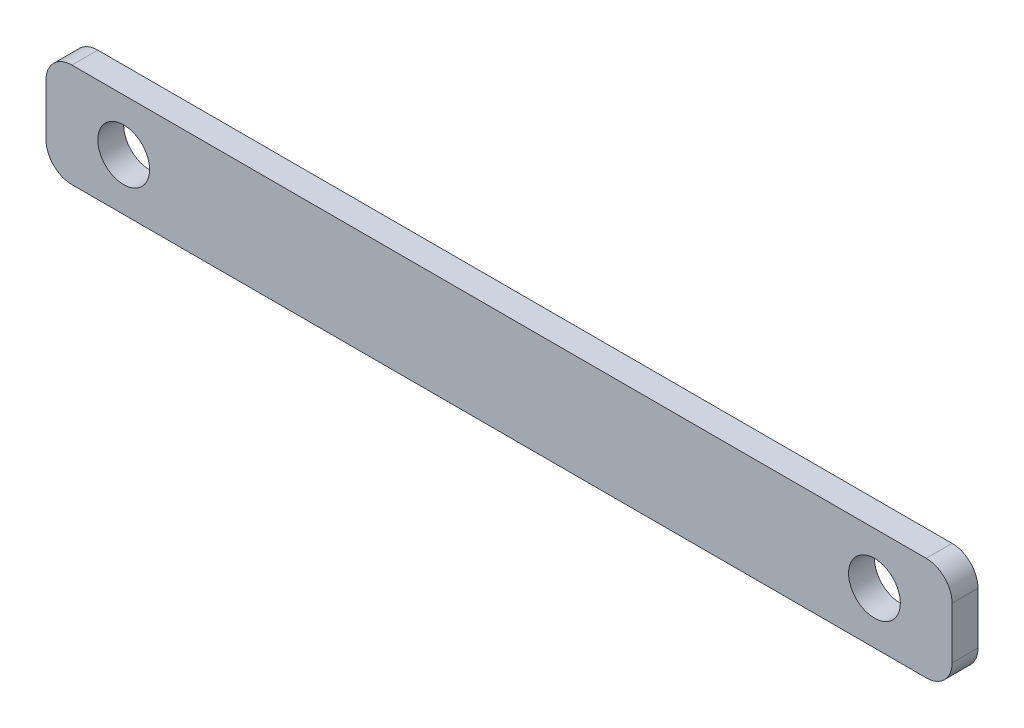
ISO-10303-21;
HEADER;
FILE_DESCRIPTION(('STEP AP214'),'2;1');
FILE_NAME('part.step','',(''),(''),'','','');
FILE_SCHEMA(('AUTOMOTIVE_DESIGN { 1 0 10303 214 1 1 1 1 }'));
ENDSEC;
DATA;
#1=APPLICATION_CONTEXT('core data for automotive mechanical design processes');
#2=APPLICATION_PROTOCOL_DEFINITION('international standard','automotive_design',2000,#1);
#3=PRODUCT_CONTEXT('',#1,'mechanical');
#4=PRODUCT('Part','Part','',(#3));
#5=PRODUCT_RELATED_PRODUCT_CATEGORY('part','',(#4));
#6=PRODUCT_DEFINITION_FORMATION('','',#4);
#7=PRODUCT_DEFINITION_CONTEXT('part definition',#1,'design');
#8=PRODUCT_DEFINITION('design','',#6,#7);
#9=PRODUCT_DEFINITION_SHAPE('','',#8);
#10=(LENGTH_UNIT() NAMED_UNIT(*) SI_UNIT(.MILLI.,.METRE.));
#11=(NAMED_UNIT(*) PLANE_ANGLE_UNIT() SI_UNIT($,.RADIAN.));
#12=(NAMED_UNIT(*) SI_UNIT($,.STERADIAN.) SOLID_ANGLE_UNIT());
#13=UNCERTAINTY_MEASURE_WITH_UNIT(LENGTH_MEASURE(1.E-05),#10,'distance_accuracy_value','');
#14=(GEOMETRIC_REPRESENTATION_CONTEXT(3) GLOBAL_UNCERTAINTY_ASSIGNED_CONTEXT((#13)) GLOBAL_UNIT_ASSIGNED_CONTEXT((#10,
#11,#12)) REPRESENTATION_CONTEXT('',''));
#15=CARTESIAN_POINT('',(0.,0.,0.));
#16=DIRECTION('',(0.,0.,1.));
#17=DIRECTION('',(1.,0.,0.));
#18=AXIS2_PLACEMENT_3D('',#15,#16,#17);
#19=CARTESIAN_POINT('',(140.,121.994660309072,5.));
#20=DIRECTION('',(0.,0.,1.));
#21=DIRECTION('',(1.,0.,0.));
#22=AXIS2_PLACEMENT_3D('',#19,#20,#21);
#23=PLANE('',#22);
#24=CARTESIAN_POINT('',(-170.,131.994660309072,5.));
#25=DIRECTION('',(0.,0.,1.));
#26=DIRECTION('',(1.,0.,0.));
#27=AXIS2_PLACEMENT_3D('',#24,#25,#26);
#28=CIRCLE('',#27,10.);
#29=CARTESIAN_POINT('',(-160.,131.994660309072,5.));
#30=VERTEX_POINT('',#29);
#31=EDGE_CURVE('E135',#30,#30,#28,.T.);
#32=ORIENTED_EDGE('',*,*,#31,.F.);
#33=EDGE_LOOP('',(#32));
#34=FACE_BOUND('',#33,.T.);
#35=CARTESIAN_POINT('',(140.,121.994660309072,5.));
#36=DIRECTION('',(0.,0.,1.));
#37=DIRECTION('',(1.,0.,0.));
#38=AXIS2_PLACEMENT_3D('',#35,#36,#37);
#39=CIRCLE('',#38,9.99999999999999);
#40=CARTESIAN_POINT('',(140.,111.994660309072,5.));
#41=VERTEX_POINT('',#40);
#42=CARTESIAN_POINT('',(150.,121.994660309072,5.));
#43=VERTEX_POINT('',#42);
#44=EDGE_CURVE('E146',#41,#43,#39,.T.);
#45=ORIENTED_EDGE('',*,*,#44,.T.);
#46=DIRECTION('',(0.,1.,0.));
#47=VECTOR('',#46,1.);
#48=CARTESIAN_POINT('',(150.,141.994660309072,5.));
#49=LINE('',#48,#47);
#50=CARTESIAN_POINT('',(150.,141.994660309072,5.));
#51=VERTEX_POINT('',#50);
#52=EDGE_CURVE('E94',#43,#51,#49,.T.);
#53=ORIENTED_EDGE('',*,*,#52,.T.);
#54=CARTESIAN_POINT('',(140.,141.994660309072,5.));
#55=DIRECTION('',(0.,0.,1.));
#56=DIRECTION('',(-1.,0.,0.));
#57=AXIS2_PLACEMENT_3D('',#54,#55,#56);
#58=CIRCLE('',#57,10.);
#59=CARTESIAN_POINT('',(140.,151.994660309072,5.));
#60=VERTEX_POINT('',#59);
#61=EDGE_CURVE('E161',#51,#60,#58,.T.);
#62=ORIENTED_EDGE('',*,*,#61,.T.);
#63=DIRECTION('',(-1.,0.,0.));
#64=VECTOR('',#63,1.);
#65=CARTESIAN_POINT('',(-190.,151.994660309072,5.));
#66=LINE('',#65,#64);
#67=CARTESIAN_POINT('',(-190.,151.994660309072,5.));
#68=VERTEX_POINT('',#67);
#69=EDGE_CURVE('E174',#60,#68,#66,.T.);
#70=ORIENTED_EDGE('',*,*,#69,.T.);
#71=CARTESIAN_POINT('',(-190.,141.994660309072,5.));
#72=DIRECTION('',(0.,0.,1.));
#73=DIRECTION('',(1.,0.,0.));
#74=AXIS2_PLACEMENT_3D('',#71,#72,#73);
#75=CIRCLE('',#74,9.99999999999999);
#76=CARTESIAN_POINT('',(-200.,141.994660309072,5.));
#77=VERTEX_POINT('',#76);
#78=EDGE_CURVE('E113',#68,#77,#75,.T.);
#79=ORIENTED_EDGE('',*,*,#78,.T.);
#80=DIRECTION('',(0.,-1.,0.));
#81=VECTOR('',#80,1.);
#82=CARTESIAN_POINT('',(-200.,141.994660309072,5.));
#83=LINE('',#82,#81);
#84=CARTESIAN_POINT('',(-200.,121.994660309072,5.));
#85=VERTEX_POINT('',#84);
#86=EDGE_CURVE('E107',#77,#85,#83,.T.);
#87=ORIENTED_EDGE('',*,*,#86,.T.);
#88=CARTESIAN_POINT('',(-190.,121.994660309072,5.));
#89=DIRECTION('',(0.,0.,1.));
#90=DIRECTION('',(1.,0.,0.));
#91=AXIS2_PLACEMENT_3D('',#88,#89,#90);
#92=CIRCLE('',#91,10.);
#93=CARTESIAN_POINT('',(-190.,111.994660309072,5.));
#94=VERTEX_POINT('',#93);
#95=EDGE_CURVE('E111',#85,#94,#92,.T.);
#96=ORIENTED_EDGE('',*,*,#95,.T.);
#97=DIRECTION('',(1.,0.,0.));
#98=VECTOR('',#97,1.);
#99=CARTESIAN_POINT('',(-190.,111.994660309072,5.));
#100=LINE('',#99,#98);
#101=EDGE_CURVE('E51',#94,#41,#100,.T.);
#102=ORIENTED_EDGE('',*,*,#101,.T.);
#103=EDGE_LOOP('',(#45,#53,#62,#70,#79,#87,#96,#102));
#104=FACE_BOUND('',#103,.T.);
#105=CARTESIAN_POINT('',(120.,131.994660309072,5.));
#106=DIRECTION('',(0.,0.,1.));
#107=DIRECTION('',(1.,0.,0.));
#108=AXIS2_PLACEMENT_3D('',#105,#106,#107);
#109=CIRCLE('',#108,10.);
#110=CARTESIAN_POINT('',(130.,131.994660309072,5.));
#111=VERTEX_POINT('',#110);
#112=EDGE_CURVE('E183',#111,#111,#109,.T.);
#113=ORIENTED_EDGE('',*,*,#112,.F.);
#114=EDGE_LOOP('',(#113));
#115=FACE_BOUND('',#114,.T.);
#116=ADVANCED_FACE('F34',(#34,#104,#115),#23,.T.);
#117=CARTESIAN_POINT('',(140.,121.994660309072,-5.));
#118=DIRECTION('',(0.,0.,1.));
#119=DIRECTION('',(1.,0.,0.));
#120=AXIS2_PLACEMENT_3D('',#117,#118,#119);
#121=PLANE('',#120);
#122=CARTESIAN_POINT('',(140.,121.994660309072,-5.));
#123=DIRECTION('',(0.,0.,1.));
#124=DIRECTION('',(1.,0.,0.));
#125=AXIS2_PLACEMENT_3D('',#122,#123,#124);
#126=CIRCLE('',#125,9.99999999999999);
#127=CARTESIAN_POINT('',(140.,111.994660309072,-5.));
#128=VERTEX_POINT('',#127);
#129=CARTESIAN_POINT('',(150.,121.994660309072,-5.));
#130=VERTEX_POINT('',#129);
#131=EDGE_CURVE('E131',#128,#130,#126,.T.);
#132=ORIENTED_EDGE('',*,*,#131,.F.);
#133=DIRECTION('',(1.,0.,0.));
#134=VECTOR('',#133,1.);
#135=CARTESIAN_POINT('',(-190.,111.994660309072,-5.));
#136=LINE('',#135,#134);
#137=CARTESIAN_POINT('',(-190.,111.994660309072,-5.));
#138=VERTEX_POINT('',#137);
#139=EDGE_CURVE('E86',#138,#128,#136,.T.);
#140=ORIENTED_EDGE('',*,*,#139,.F.);
#141=CARTESIAN_POINT('',(-190.,121.994660309072,-5.));
#142=DIRECTION('',(0.,0.,1.));
#143=DIRECTION('',(1.,0.,0.));
#144=AXIS2_PLACEMENT_3D('',#141,#142,#143);
#145=CIRCLE('',#144,10.);
#146=CARTESIAN_POINT('',(-200.,121.994660309072,-5.));
#147=VERTEX_POINT('',#146);
#148=EDGE_CURVE('E80',#147,#138,#145,.T.);
#149=ORIENTED_EDGE('',*,*,#148,.F.);
#150=DIRECTION('',(0.,-1.,0.));
#151=VECTOR('',#150,1.);
#152=CARTESIAN_POINT('',(-200.,141.994660309072,-5.));
#153=LINE('',#152,#151);
#154=CARTESIAN_POINT('',(-200.,141.994660309072,-5.));
#155=VERTEX_POINT('',#154);
#156=EDGE_CURVE('E121',#155,#147,#153,.T.);
#157=ORIENTED_EDGE('',*,*,#156,.F.);
#158=CARTESIAN_POINT('',(-190.,141.994660309072,-5.));
#159=DIRECTION('',(0.,0.,1.));
#160=DIRECTION('',(1.,0.,0.));
#161=AXIS2_PLACEMENT_3D('',#158,#159,#160);
#162=CIRCLE('',#161,9.99999999999999);
#163=CARTESIAN_POINT('',(-190.,151.994660309072,-5.));
#164=VERTEX_POINT('',#163);
#165=EDGE_CURVE('E141',#164,#155,#162,.T.);
#166=ORIENTED_EDGE('',*,*,#165,.F.);
#167=DIRECTION('',(-1.,0.,0.));
#168=VECTOR('',#167,1.);
#169=CARTESIAN_POINT('',(-190.,151.994660309072,-5.));
#170=LINE('',#169,#168);
#171=CARTESIAN_POINT('',(140.,151.994660309072,-5.));
#172=VERTEX_POINT('',#171);
#173=EDGE_CURVE('E139',#172,#164,#170,.T.);
#174=ORIENTED_EDGE('',*,*,#173,.F.);
#175=CARTESIAN_POINT('',(140.,141.994660309072,-5.));
#176=DIRECTION('',(0.,0.,1.));
#177=DIRECTION('',(-1.,0.,0.));
#178=AXIS2_PLACEMENT_3D('',#175,#176,#177);
#179=CIRCLE('',#178,10.);
#180=CARTESIAN_POINT('',(150.,141.994660309072,-5.));
#181=VERTEX_POINT('',#180);
#182=EDGE_CURVE('E137',#181,#172,#179,.T.);
#183=ORIENTED_EDGE('',*,*,#182,.F.);
#184=DIRECTION('',(0.,1.,0.));
#185=VECTOR('',#184,1.);
#186=CARTESIAN_POINT('',(150.,141.994660309072,-5.));
#187=LINE('',#186,#185);
#188=EDGE_CURVE('E134',#130,#181,#187,.T.);
#189=ORIENTED_EDGE('',*,*,#188,.F.);
#190=EDGE_LOOP('',(#132,#140,#149,#157,#166,#174,#183,#189));
#191=FACE_BOUND('',#190,.T.);
#192=CARTESIAN_POINT('',(-170.,131.994660309072,-5.));
#193=DIRECTION('',(0.,0.,1.));
#194=DIRECTION('',(1.,0.,0.));
#195=AXIS2_PLACEMENT_3D('',#192,#193,#194);
#196=CIRCLE('',#195,10.);
#197=CARTESIAN_POINT('',(-160.,131.994660309072,-5.));
#198=VERTEX_POINT('',#197);
#199=EDGE_CURVE('E180',#198,#198,#196,.T.);
#200=ORIENTED_EDGE('',*,*,#199,.T.);
#201=EDGE_LOOP('',(#200));
#202=FACE_BOUND('',#201,.T.);
#203=CARTESIAN_POINT('',(120.,131.994660309072,-5.));
#204=DIRECTION('',(0.,0.,1.));
#205=DIRECTION('',(1.,0.,0.));
#206=AXIS2_PLACEMENT_3D('',#203,#204,#205);
#207=CIRCLE('',#206,10.);
#208=CARTESIAN_POINT('',(130.,131.994660309072,-5.));
#209=VERTEX_POINT('',#208);
#210=EDGE_CURVE('E186',#209,#209,#207,.T.);
#211=ORIENTED_EDGE('',*,*,#210,.T.);
#212=EDGE_LOOP('',(#211));
#213=FACE_BOUND('',#212,.T.);
#214=ADVANCED_FACE('F165',(#191,#202,#213),#121,.F.);
#215=CARTESIAN_POINT('',(140.,121.994660309072,5.));
#216=DIRECTION('',(0.,0.,-1.));
#217=DIRECTION('',(-1.,0.,0.));
#218=AXIS2_PLACEMENT_3D('',#215,#216,#217);
#219=CYLINDRICAL_SURFACE('',#218,9.99999999999999);
#220=ORIENTED_EDGE('',*,*,#131,.T.);
#221=DIRECTION('',(0.,0.,-1.));
#222=VECTOR('',#221,1.);
#223=CARTESIAN_POINT('',(150.,121.994660309072,5.));
#224=LINE('',#223,#222);
#225=EDGE_CURVE('E11',#43,#130,#224,.T.);
#226=ORIENTED_EDGE('',*,*,#225,.F.);
#227=ORIENTED_EDGE('',*,*,#44,.F.);
#228=DIRECTION('',(0.,0.,-1.));
#229=VECTOR('',#228,1.);
#230=CARTESIAN_POINT('',(140.,111.994660309072,5.));
#231=LINE('',#230,#229);
#232=EDGE_CURVE('E127',#41,#128,#231,.T.);
#233=ORIENTED_EDGE('',*,*,#232,.T.);
#234=EDGE_LOOP('',(#220,#226,#227,#233));
#235=FACE_BOUND('',#234,.T.);
#236=ADVANCED_FACE('F36',(#235),#219,.T.);
#237=CARTESIAN_POINT('',(150.,141.994660309072,5.));
#238=DIRECTION('',(-1.,0.,0.));
#239=DIRECTION('',(0.,0.,1.));
#240=AXIS2_PLACEMENT_3D('',#237,#238,#239);
#241=PLANE('',#240);
#242=ORIENTED_EDGE('',*,*,#188,.T.);
#243=DIRECTION('',(0.,0.,-1.));
#244=VECTOR('',#243,1.);
#245=CARTESIAN_POINT('',(150.,141.994660309072,5.));
#246=LINE('',#245,#244);
#247=EDGE_CURVE('E43',#51,#181,#246,.T.);
#248=ORIENTED_EDGE('',*,*,#247,.F.);
#249=ORIENTED_EDGE('',*,*,#52,.F.);
#250=ORIENTED_EDGE('',*,*,#225,.T.);
#251=EDGE_LOOP('',(#242,#248,#249,#250));
#252=FACE_BOUND('',#251,.T.);
#253=ADVANCED_FACE('F218',(#252),#241,.F.);
#254=CARTESIAN_POINT('',(140.,141.994660309072,5.));
#255=DIRECTION('',(0.,0.,-1.));
#256=DIRECTION('',(-1.,0.,0.));
#257=AXIS2_PLACEMENT_3D('',#254,#255,#256);
#258=CYLINDRICAL_SURFACE('',#257,10.);
#259=ORIENTED_EDGE('',*,*,#182,.T.);
#260=DIRECTION('',(0.,0.,-1.));
#261=VECTOR('',#260,1.);
#262=CARTESIAN_POINT('',(140.,151.994660309072,5.));
#263=LINE('',#262,#261);
#264=EDGE_CURVE('E153',#60,#172,#263,.T.);
#265=ORIENTED_EDGE('',*,*,#264,.F.);
#266=ORIENTED_EDGE('',*,*,#61,.F.);
#267=ORIENTED_EDGE('',*,*,#247,.T.);
#268=EDGE_LOOP('',(#259,#265,#266,#267));
#269=FACE_BOUND('',#268,.T.);
#270=ADVANCED_FACE('F159',(#269),#258,.T.);
#271=CARTESIAN_POINT('',(-190.,151.994660309072,5.));
#272=DIRECTION('',(0.,-1.,0.));
#273=DIRECTION('',(1.,0.,0.));
#274=AXIS2_PLACEMENT_3D('',#271,#272,#273);
#275=PLANE('',#274);
#276=ORIENTED_EDGE('',*,*,#173,.T.);
#277=DIRECTION('',(0.,0.,-1.));
#278=VECTOR('',#277,1.);
#279=CARTESIAN_POINT('',(-190.,151.994660309072,5.));
#280=LINE('',#279,#278);
#281=EDGE_CURVE('E150',#68,#164,#280,.T.);
#282=ORIENTED_EDGE('',*,*,#281,.F.);
#283=ORIENTED_EDGE('',*,*,#69,.F.);
#284=ORIENTED_EDGE('',*,*,#264,.T.);
#285=EDGE_LOOP('',(#276,#282,#283,#284));
#286=FACE_BOUND('',#285,.T.);
#287=ADVANCED_FACE('F170',(#286),#275,.F.);
#288=CARTESIAN_POINT('',(-190.,141.994660309072,5.));
#289=DIRECTION('',(0.,0.,-1.));
#290=DIRECTION('',(-1.,0.,0.));
#291=AXIS2_PLACEMENT_3D('',#288,#289,#290);
#292=CYLINDRICAL_SURFACE('',#291,9.99999999999999);
#293=ORIENTED_EDGE('',*,*,#165,.T.);
#294=DIRECTION('',(0.,0.,-1.));
#295=VECTOR('',#294,1.);
#296=CARTESIAN_POINT('',(-200.,141.994660309072,5.));
#297=LINE('',#296,#295);
#298=EDGE_CURVE('E122',#77,#155,#297,.T.);
#299=ORIENTED_EDGE('',*,*,#298,.F.);
#300=ORIENTED_EDGE('',*,*,#78,.F.);
#301=ORIENTED_EDGE('',*,*,#281,.T.);
#302=EDGE_LOOP('',(#293,#299,#300,#301));
#303=FACE_BOUND('',#302,.T.);
#304=ADVANCED_FACE('F173',(#303),#292,.T.);
#305=CARTESIAN_POINT('',(-200.,141.994660309072,5.));
#306=DIRECTION('',(1.,0.,0.));
#307=DIRECTION('',(0.,0.,-1.));
#308=AXIS2_PLACEMENT_3D('',#305,#306,#307);
#309=PLANE('',#308);
#310=ORIENTED_EDGE('',*,*,#156,.T.);
#311=DIRECTION('',(0.,0.,-1.));
#312=VECTOR('',#311,1.);
#313=CARTESIAN_POINT('',(-200.,121.994660309072,5.));
#314=LINE('',#313,#312);
#315=EDGE_CURVE('E118',#85,#147,#314,.T.);
#316=ORIENTED_EDGE('',*,*,#315,.F.);
#317=ORIENTED_EDGE('',*,*,#86,.F.);
#318=ORIENTED_EDGE('',*,*,#298,.T.);
#319=EDGE_LOOP('',(#310,#316,#317,#318));
#320=FACE_BOUND('',#319,.T.);
#321=ADVANCED_FACE('F119',(#320),#309,.F.);
#322=CARTESIAN_POINT('',(-190.,121.994660309072,5.));
#323=DIRECTION('',(0.,0.,-1.));
#324=DIRECTION('',(-1.,0.,0.));
#325=AXIS2_PLACEMENT_3D('',#322,#323,#324);
#326=CYLINDRICAL_SURFACE('',#325,10.);
#327=ORIENTED_EDGE('',*,*,#148,.T.);
#328=DIRECTION('',(0.,0.,-1.));
#329=VECTOR('',#328,1.);
#330=CARTESIAN_POINT('',(-190.,111.994660309072,5.));
#331=LINE('',#330,#329);
#332=EDGE_CURVE('E123',#94,#138,#331,.T.);
#333=ORIENTED_EDGE('',*,*,#332,.F.);
#334=ORIENTED_EDGE('',*,*,#95,.F.);
#335=ORIENTED_EDGE('',*,*,#315,.T.);
#336=EDGE_LOOP('',(#327,#333,#334,#335));
#337=FACE_BOUND('',#336,.T.);
#338=ADVANCED_FACE('F125',(#337),#326,.T.);
#339=CARTESIAN_POINT('',(-190.,111.994660309072,5.));
#340=DIRECTION('',(0.,1.,0.));
#341=DIRECTION('',(-1.,0.,0.));
#342=AXIS2_PLACEMENT_3D('',#339,#340,#341);
#343=PLANE('',#342);
#344=ORIENTED_EDGE('',*,*,#139,.T.);
#345=ORIENTED_EDGE('',*,*,#232,.F.);
#346=ORIENTED_EDGE('',*,*,#101,.F.);
#347=ORIENTED_EDGE('',*,*,#332,.T.);
#348=EDGE_LOOP('',(#344,#345,#346,#347));
#349=FACE_BOUND('',#348,.T.);
#350=ADVANCED_FACE('F206',(#349),#343,.F.);
#351=CARTESIAN_POINT('',(-170.,131.994660309072,5.));
#352=DIRECTION('',(0.,0.,-1.));
#353=DIRECTION('',(-1.,0.,0.));
#354=AXIS2_PLACEMENT_3D('',#351,#352,#353);
#355=CYLINDRICAL_SURFACE('',#354,10.);
#356=ORIENTED_EDGE('',*,*,#31,.T.);
#357=EDGE_LOOP('',(#356));
#358=FACE_BOUND('',#357,.T.);
#359=ORIENTED_EDGE('',*,*,#199,.F.);
#360=EDGE_LOOP('',(#359));
#361=FACE_BOUND('',#360,.T.);
#362=ADVANCED_FACE('F203',(#358,#361),#355,.F.);
#363=CARTESIAN_POINT('',(120.,131.994660309072,5.));
#364=DIRECTION('',(0.,0.,-1.));
#365=DIRECTION('',(-1.,0.,0.));
#366=AXIS2_PLACEMENT_3D('',#363,#364,#365);
#367=CYLINDRICAL_SURFACE('',#366,10.);
#368=ORIENTED_EDGE('',*,*,#112,.T.);
#369=EDGE_LOOP('',(#368));
#370=FACE_BOUND('',#369,.T.);
#371=ORIENTED_EDGE('',*,*,#210,.F.);
#372=EDGE_LOOP('',(#371));
#373=FACE_BOUND('',#372,.T.);
#374=ADVANCED_FACE('F192',(#370,#373),#367,.F.);
#375=CLOSED_SHELL('',(#116,#214,#236,#253,#270,#287,#304,#321,#338,#350,#362,#374));
#376=MANIFOLD_SOLID_BREP('B2',#375);
#377=ADVANCED_BREP_SHAPE_REPRESENTATION('',(#18,#376),#14);
#378=SHAPE_DEFINITION_REPRESENTATION(#9,#377);
ENDSEC;
END-ISO-10303-21;
